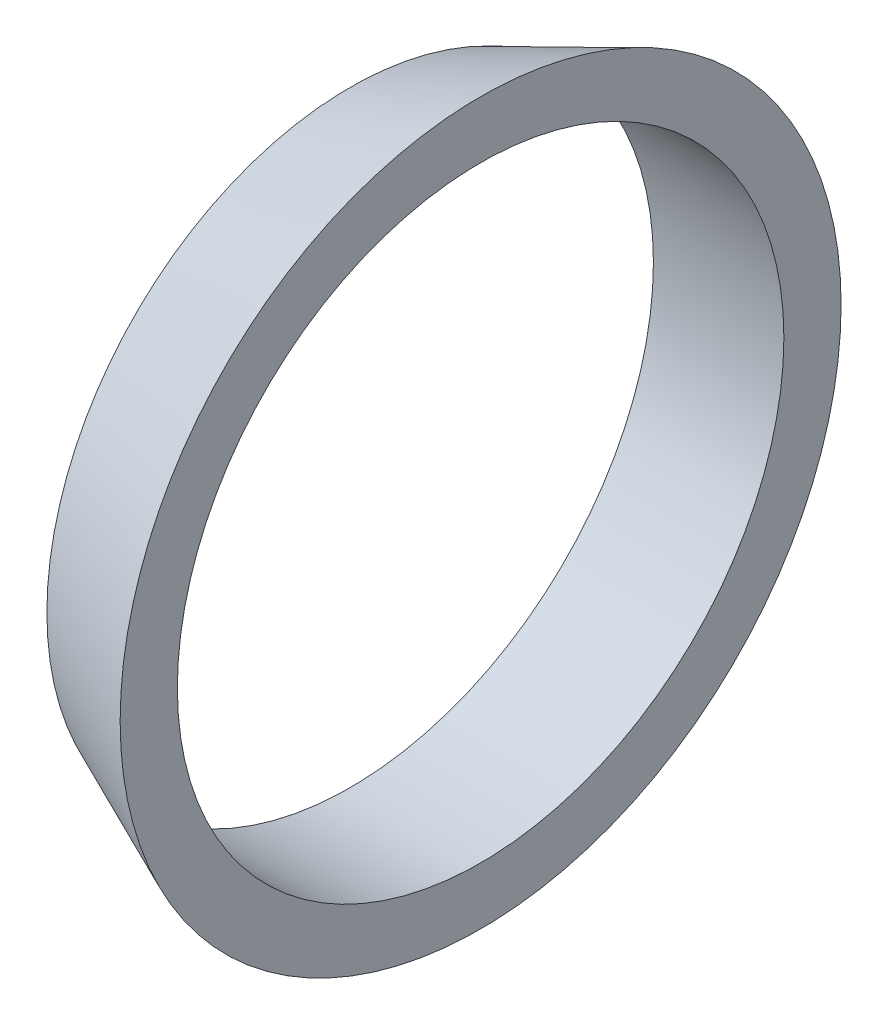
ISO-10303-21;
HEADER;
FILE_DESCRIPTION(('STEP AP214'),'2;1');
FILE_NAME('part.step','',(''),(''),'','','');
FILE_SCHEMA(('AUTOMOTIVE_DESIGN { 1 0 10303 214 1 1 1 1 }'));
ENDSEC;
DATA;
#1=APPLICATION_CONTEXT('core data for automotive mechanical design processes');
#2=APPLICATION_PROTOCOL_DEFINITION('international standard','automotive_design',2000,#1);
#3=PRODUCT_CONTEXT('',#1,'mechanical');
#4=PRODUCT('Part','Part','',(#3));
#5=PRODUCT_RELATED_PRODUCT_CATEGORY('part','',(#4));
#6=PRODUCT_DEFINITION_FORMATION('','',#4);
#7=PRODUCT_DEFINITION_CONTEXT('part definition',#1,'design');
#8=PRODUCT_DEFINITION('design','',#6,#7);
#9=PRODUCT_DEFINITION_SHAPE('','',#8);
#10=(LENGTH_UNIT() NAMED_UNIT(*) SI_UNIT(.MILLI.,.METRE.));
#11=(NAMED_UNIT(*) PLANE_ANGLE_UNIT() SI_UNIT($,.RADIAN.));
#12=(NAMED_UNIT(*) SI_UNIT($,.STERADIAN.) SOLID_ANGLE_UNIT());
#13=UNCERTAINTY_MEASURE_WITH_UNIT(LENGTH_MEASURE(1.E-05),#10,'distance_accuracy_value','');
#14=(GEOMETRIC_REPRESENTATION_CONTEXT(3) GLOBAL_UNCERTAINTY_ASSIGNED_CONTEXT((#13)) GLOBAL_UNIT_ASSIGNED_CONTEXT((#10,
#11,#12)) REPRESENTATION_CONTEXT('',''));
#15=CARTESIAN_POINT('',(0.,0.,0.));
#16=DIRECTION('',(0.,0.,1.));
#17=DIRECTION('',(1.,0.,0.));
#18=AXIS2_PLACEMENT_3D('',#15,#16,#17);
#19=CARTESIAN_POINT('',(0.,0.,0.));
#20=DIRECTION('',(1.,0.,0.));
#21=DIRECTION('',(0.,0.,-1.));
#22=AXIS2_PLACEMENT_3D('',#19,#20,#21);
#23=CYLINDRICAL_SURFACE('',#22,13.25);
#24=CARTESIAN_POINT('',(-5.7,0.,0.));
#25=DIRECTION('',(1.,0.,0.));
#26=DIRECTION('',(0.,0.,-1.));
#27=AXIS2_PLACEMENT_3D('',#24,#25,#26);
#28=CIRCLE('',#27,13.25);
#29=CARTESIAN_POINT('',(-5.7,0.,-13.25));
#30=VERTEX_POINT('',#29);
#31=EDGE_CURVE('E23',#30,#30,#28,.T.);
#32=ORIENTED_EDGE('',*,*,#31,.F.);
#33=EDGE_LOOP('',(#32));
#34=FACE_BOUND('',#33,.T.);
#35=CARTESIAN_POINT('',(0.,0.,0.));
#36=DIRECTION('',(1.,0.,0.));
#37=DIRECTION('',(0.,0.,-1.));
#38=AXIS2_PLACEMENT_3D('',#35,#36,#37);
#39=CIRCLE('',#38,13.25);
#40=CARTESIAN_POINT('',(0.,0.,-13.25));
#41=VERTEX_POINT('',#40);
#42=EDGE_CURVE('E19',#41,#41,#39,.F.);
#43=ORIENTED_EDGE('',*,*,#42,.F.);
#44=EDGE_LOOP('',(#43));
#45=FACE_BOUND('',#44,.T.);
#46=ADVANCED_FACE('F16',(#34,#45),#23,.F.);
#47=CARTESIAN_POINT('',(0.,15.75,0.));
#48=DIRECTION('',(1.,0.,0.));
#49=DIRECTION('',(0.,0.,-1.));
#50=AXIS2_PLACEMENT_3D('',#47,#48,#49);
#51=PLANE('',#50);
#52=ORIENTED_EDGE('',*,*,#42,.T.);
#53=EDGE_LOOP('',(#52));
#54=FACE_BOUND('',#53,.T.);
#55=CARTESIAN_POINT('',(0.,0.,0.));
#56=DIRECTION('',(1.,0.,0.));
#57=DIRECTION('',(0.,0.,-1.));
#58=AXIS2_PLACEMENT_3D('',#55,#56,#57);
#59=CIRCLE('',#58,15.75);
#60=CARTESIAN_POINT('',(0.,0.,-15.75));
#61=VERTEX_POINT('',#60);
#62=EDGE_CURVE('E10',#61,#61,#59,.F.);
#63=ORIENTED_EDGE('',*,*,#62,.F.);
#64=EDGE_LOOP('',(#63));
#65=FACE_BOUND('',#64,.T.);
#66=ADVANCED_FACE('F33',(#54,#65),#51,.T.);
#67=CARTESIAN_POINT('',(0.,0.,0.));
#68=DIRECTION('',(1.,0.,0.));
#69=DIRECTION('',(0.,0.,-1.));
#70=AXIS2_PLACEMENT_3D('',#67,#68,#69);
#71=CONICAL_SURFACE('',#70,15.75,0.413330404539328);
#72=ORIENTED_EDGE('',*,*,#62,.T.);
#73=EDGE_LOOP('',(#72));
#74=FACE_BOUND('',#73,.T.);
#75=ORIENTED_EDGE('',*,*,#31,.T.);
#76=EDGE_LOOP('',(#75));
#77=FACE_BOUND('',#76,.T.);
#78=ADVANCED_FACE('F41',(#74,#77),#71,.T.);
#79=CLOSED_SHELL('',(#46,#66,#78));
#80=MANIFOLD_SOLID_BREP('B1',#79);
#81=ADVANCED_BREP_SHAPE_REPRESENTATION('',(#18,#80),#14);
#82=SHAPE_DEFINITION_REPRESENTATION(#9,#81);
ENDSEC;
END-ISO-10303-21;
